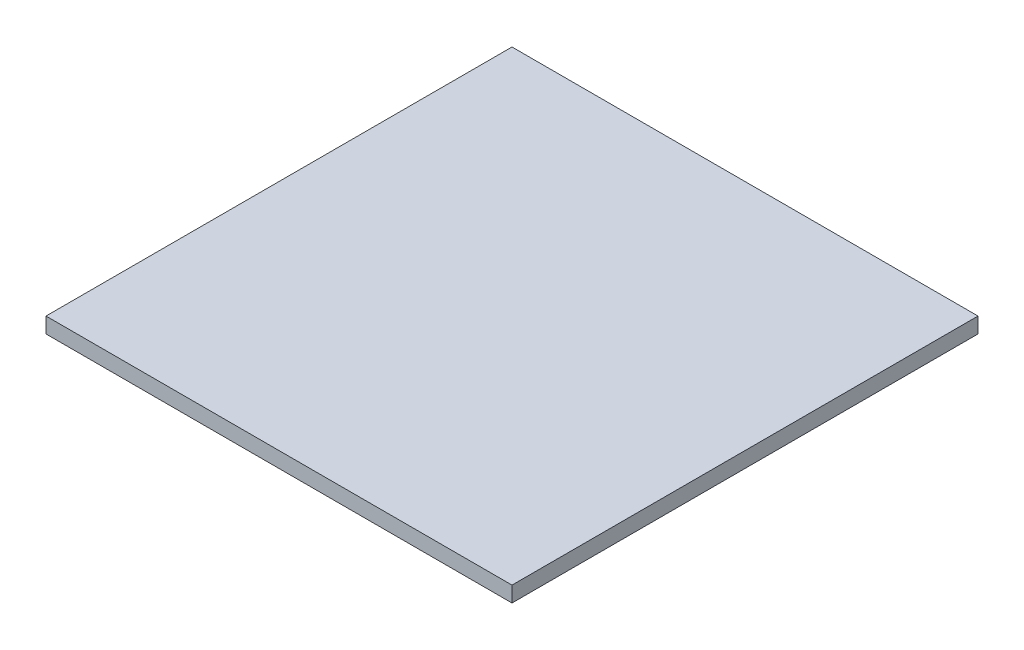
ISO-10303-21;
HEADER;
FILE_DESCRIPTION(('STEP AP214'),'2;1');
FILE_NAME('part.step','',(''),(''),'','','');
FILE_SCHEMA(('AUTOMOTIVE_DESIGN { 1 0 10303 214 1 1 1 1 }'));
ENDSEC;
DATA;
#1=APPLICATION_CONTEXT('core data for automotive mechanical design processes');
#2=APPLICATION_PROTOCOL_DEFINITION('international standard','automotive_design',2000,#1);
#3=PRODUCT_CONTEXT('',#1,'mechanical');
#4=PRODUCT('Part','Part','',(#3));
#5=PRODUCT_RELATED_PRODUCT_CATEGORY('part','',(#4));
#6=PRODUCT_DEFINITION_FORMATION('','',#4);
#7=PRODUCT_DEFINITION_CONTEXT('part definition',#1,'design');
#8=PRODUCT_DEFINITION('design','',#6,#7);
#9=PRODUCT_DEFINITION_SHAPE('','',#8);
#10=(LENGTH_UNIT() NAMED_UNIT(*) SI_UNIT(.MILLI.,.METRE.));
#11=(NAMED_UNIT(*) PLANE_ANGLE_UNIT() SI_UNIT($,.RADIAN.));
#12=(NAMED_UNIT(*) SI_UNIT($,.STERADIAN.) SOLID_ANGLE_UNIT());
#13=UNCERTAINTY_MEASURE_WITH_UNIT(LENGTH_MEASURE(1.E-05),#10,'distance_accuracy_value','');
#14=(GEOMETRIC_REPRESENTATION_CONTEXT(3) GLOBAL_UNCERTAINTY_ASSIGNED_CONTEXT((#13)) GLOBAL_UNIT_ASSIGNED_CONTEXT((#10,
#11,#12)) REPRESENTATION_CONTEXT('',''));
#15=CARTESIAN_POINT('',(0.,0.,0.));
#16=DIRECTION('',(0.,0.,1.));
#17=DIRECTION('',(1.,0.,0.));
#18=AXIS2_PLACEMENT_3D('',#15,#16,#17);
#19=CARTESIAN_POINT('',(1500.,100.,1500.));
#20=DIRECTION('',(-1.,0.,0.));
#21=DIRECTION('',(0.,0.,1.));
#22=AXIS2_PLACEMENT_3D('',#19,#20,#21);
#23=PLANE('',#22);
#24=DIRECTION('',(0.,0.,-1.));
#25=VECTOR('',#24,1.);
#26=CARTESIAN_POINT('',(1500.,0.,1500.));
#27=LINE('',#26,#25);
#28=CARTESIAN_POINT('',(1500.,0.,1500.));
#29=VERTEX_POINT('',#28);
#30=CARTESIAN_POINT('',(1500.,0.,-1500.));
#31=VERTEX_POINT('',#30);
#32=EDGE_CURVE('E98',#29,#31,#27,.T.);
#33=ORIENTED_EDGE('',*,*,#32,.T.);
#34=DIRECTION('',(0.,-1.,0.));
#35=VECTOR('',#34,1.);
#36=CARTESIAN_POINT('',(1500.,100.,-1500.));
#37=LINE('',#36,#35);
#38=CARTESIAN_POINT('',(1500.,100.,-1500.));
#39=VERTEX_POINT('',#38);
#40=EDGE_CURVE('E11',#39,#31,#37,.T.);
#41=ORIENTED_EDGE('',*,*,#40,.F.);
#42=DIRECTION('',(0.,0.,-1.));
#43=VECTOR('',#42,1.);
#44=CARTESIAN_POINT('',(1500.,100.,1500.));
#45=LINE('',#44,#43);
#46=CARTESIAN_POINT('',(1500.,100.,1500.));
#47=VERTEX_POINT('',#46);
#48=EDGE_CURVE('E86',#47,#39,#45,.T.);
#49=ORIENTED_EDGE('',*,*,#48,.F.);
#50=DIRECTION('',(0.,-1.,0.));
#51=VECTOR('',#50,1.);
#52=CARTESIAN_POINT('',(1500.,100.,1500.));
#53=LINE('',#52,#51);
#54=EDGE_CURVE('E94',#47,#29,#53,.T.);
#55=ORIENTED_EDGE('',*,*,#54,.T.);
#56=EDGE_LOOP('',(#33,#41,#49,#55));
#57=FACE_BOUND('',#56,.T.);
#58=ADVANCED_FACE('F35',(#57),#23,.F.);
#59=CARTESIAN_POINT('',(-1500.,100.,-1500.));
#60=DIRECTION('',(0.,0.,1.));
#61=DIRECTION('',(1.,0.,0.));
#62=AXIS2_PLACEMENT_3D('',#59,#60,#61);
#63=PLANE('',#62);
#64=DIRECTION('',(-1.,0.,0.));
#65=VECTOR('',#64,1.);
#66=CARTESIAN_POINT('',(-1500.,0.,-1500.));
#67=LINE('',#66,#65);
#68=CARTESIAN_POINT('',(-1500.,0.,-1500.));
#69=VERTEX_POINT('',#68);
#70=EDGE_CURVE('E90',#31,#69,#67,.T.);
#71=ORIENTED_EDGE('',*,*,#70,.T.);
#72=DIRECTION('',(0.,-1.,0.));
#73=VECTOR('',#72,1.);
#74=CARTESIAN_POINT('',(-1500.,100.,-1500.));
#75=LINE('',#74,#73);
#76=CARTESIAN_POINT('',(-1500.,100.,-1500.));
#77=VERTEX_POINT('',#76);
#78=EDGE_CURVE('E43',#77,#69,#75,.T.);
#79=ORIENTED_EDGE('',*,*,#78,.F.);
#80=DIRECTION('',(-1.,0.,0.));
#81=VECTOR('',#80,1.);
#82=CARTESIAN_POINT('',(-1500.,100.,-1500.));
#83=LINE('',#82,#81);
#84=EDGE_CURVE('E81',#39,#77,#83,.T.);
#85=ORIENTED_EDGE('',*,*,#84,.F.);
#86=ORIENTED_EDGE('',*,*,#40,.T.);
#87=EDGE_LOOP('',(#71,#79,#85,#86));
#88=FACE_BOUND('',#87,.T.);
#89=ADVANCED_FACE('F89',(#88),#63,.F.);
#90=CARTESIAN_POINT('',(-1500.,100.,1500.));
#91=DIRECTION('',(1.,0.,0.));
#92=DIRECTION('',(0.,0.,-1.));
#93=AXIS2_PLACEMENT_3D('',#90,#91,#92);
#94=PLANE('',#93);
#95=DIRECTION('',(0.,0.,1.));
#96=VECTOR('',#95,1.);
#97=CARTESIAN_POINT('',(-1500.,0.,1500.));
#98=LINE('',#97,#96);
#99=CARTESIAN_POINT('',(-1500.,0.,1500.));
#100=VERTEX_POINT('',#99);
#101=EDGE_CURVE('E68',#69,#100,#98,.T.);
#102=ORIENTED_EDGE('',*,*,#101,.T.);
#103=DIRECTION('',(0.,-1.,0.));
#104=VECTOR('',#103,1.);
#105=CARTESIAN_POINT('',(-1500.,100.,1500.));
#106=LINE('',#105,#104);
#107=CARTESIAN_POINT('',(-1500.,100.,1500.));
#108=VERTEX_POINT('',#107);
#109=EDGE_CURVE('E91',#108,#100,#106,.T.);
#110=ORIENTED_EDGE('',*,*,#109,.F.);
#111=DIRECTION('',(0.,0.,1.));
#112=VECTOR('',#111,1.);
#113=CARTESIAN_POINT('',(-1500.,100.,1500.));
#114=LINE('',#113,#112);
#115=EDGE_CURVE('E84',#77,#108,#114,.T.);
#116=ORIENTED_EDGE('',*,*,#115,.F.);
#117=ORIENTED_EDGE('',*,*,#78,.T.);
#118=EDGE_LOOP('',(#102,#110,#116,#117));
#119=FACE_BOUND('',#118,.T.);
#120=ADVANCED_FACE('F92',(#119),#94,.F.);
#121=CARTESIAN_POINT('',(-1500.,100.,1500.));
#122=DIRECTION('',(0.,0.,-1.));
#123=DIRECTION('',(-1.,0.,0.));
#124=AXIS2_PLACEMENT_3D('',#121,#122,#123);
#125=PLANE('',#124);
#126=DIRECTION('',(1.,0.,0.));
#127=VECTOR('',#126,1.);
#128=CARTESIAN_POINT('',(-1500.,0.,1500.));
#129=LINE('',#128,#127);
#130=EDGE_CURVE('E74',#100,#29,#129,.T.);
#131=ORIENTED_EDGE('',*,*,#130,.T.);
#132=ORIENTED_EDGE('',*,*,#54,.F.);
#133=DIRECTION('',(1.,0.,0.));
#134=VECTOR('',#133,1.);
#135=CARTESIAN_POINT('',(-1500.,100.,1500.));
#136=LINE('',#135,#134);
#137=EDGE_CURVE('E51',#108,#47,#136,.T.);
#138=ORIENTED_EDGE('',*,*,#137,.F.);
#139=ORIENTED_EDGE('',*,*,#109,.T.);
#140=EDGE_LOOP('',(#131,#132,#138,#139));
#141=FACE_BOUND('',#140,.T.);
#142=ADVANCED_FACE('F105',(#141),#125,.F.);
#143=CARTESIAN_POINT('',(0.,100.,0.));
#144=DIRECTION('',(0.,-1.,0.));
#145=DIRECTION('',(0.,0.,-1.));
#146=AXIS2_PLACEMENT_3D('',#143,#144,#145);
#147=PLANE('',#146);
#148=ORIENTED_EDGE('',*,*,#48,.T.);
#149=ORIENTED_EDGE('',*,*,#84,.T.);
#150=ORIENTED_EDGE('',*,*,#115,.T.);
#151=ORIENTED_EDGE('',*,*,#137,.T.);
#152=EDGE_LOOP('',(#148,#149,#150,#151));
#153=FACE_BOUND('',#152,.T.);
#154=ADVANCED_FACE('F82',(#153),#147,.F.);
#155=CARTESIAN_POINT('',(0.,0.,0.));
#156=DIRECTION('',(0.,-1.,0.));
#157=DIRECTION('',(0.,0.,-1.));
#158=AXIS2_PLACEMENT_3D('',#155,#156,#157);
#159=PLANE('',#158);
#160=ORIENTED_EDGE('',*,*,#32,.F.);
#161=ORIENTED_EDGE('',*,*,#130,.F.);
#162=ORIENTED_EDGE('',*,*,#101,.F.);
#163=ORIENTED_EDGE('',*,*,#70,.F.);
#164=EDGE_LOOP('',(#160,#161,#162,#163));
#165=FACE_BOUND('',#164,.T.);
#166=ADVANCED_FACE('F108',(#165),#159,.T.);
#167=CLOSED_SHELL('',(#58,#89,#120,#142,#154,#166));
#168=MANIFOLD_SOLID_BREP('B2',#167);
#169=ADVANCED_BREP_SHAPE_REPRESENTATION('',(#18,#168),#14);
#170=SHAPE_DEFINITION_REPRESENTATION(#9,#169);
ENDSEC;
END-ISO-10303-21;
